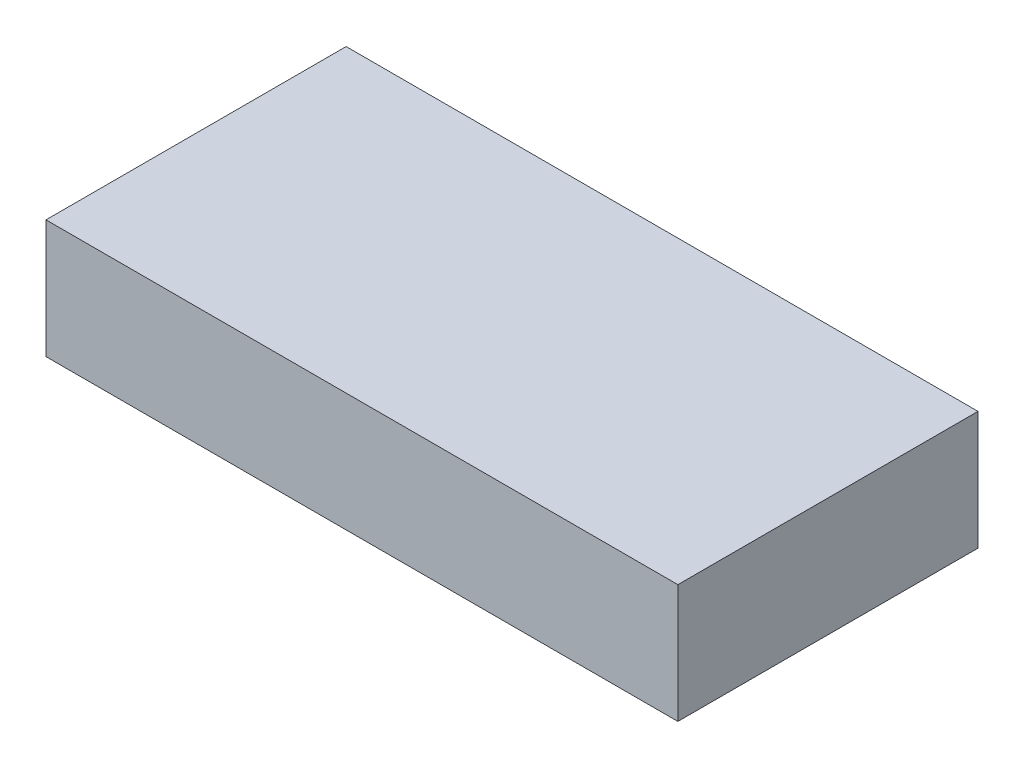
ISO-10303-21;
HEADER;
FILE_DESCRIPTION(('STEP AP214'),'2;1');
FILE_NAME('part.step','',(''),(''),'','','');
FILE_SCHEMA(('AUTOMOTIVE_DESIGN { 1 0 10303 214 1 1 1 1 }'));
ENDSEC;
DATA;
#1=APPLICATION_CONTEXT('core data for automotive mechanical design processes');
#2=APPLICATION_PROTOCOL_DEFINITION('international standard','automotive_design',2000,#1);
#3=PRODUCT_CONTEXT('',#1,'mechanical');
#4=PRODUCT('Part','Part','',(#3));
#5=PRODUCT_RELATED_PRODUCT_CATEGORY('part','',(#4));
#6=PRODUCT_DEFINITION_FORMATION('','',#4);
#7=PRODUCT_DEFINITION_CONTEXT('part definition',#1,'design');
#8=PRODUCT_DEFINITION('design','',#6,#7);
#9=PRODUCT_DEFINITION_SHAPE('','',#8);
#10=(LENGTH_UNIT() NAMED_UNIT(*) SI_UNIT(.MILLI.,.METRE.));
#11=(NAMED_UNIT(*) PLANE_ANGLE_UNIT() SI_UNIT($,.RADIAN.));
#12=(NAMED_UNIT(*) SI_UNIT($,.STERADIAN.) SOLID_ANGLE_UNIT());
#13=UNCERTAINTY_MEASURE_WITH_UNIT(LENGTH_MEASURE(1.E-05),#10,'distance_accuracy_value','');
#14=(GEOMETRIC_REPRESENTATION_CONTEXT(3) GLOBAL_UNCERTAINTY_ASSIGNED_CONTEXT((#13)) GLOBAL_UNIT_ASSIGNED_CONTEXT((#10,
#11,#12)) REPRESENTATION_CONTEXT('',''));
#15=CARTESIAN_POINT('',(0.,0.,0.));
#16=DIRECTION('',(0.,0.,1.));
#17=DIRECTION('',(1.,0.,0.));
#18=AXIS2_PLACEMENT_3D('',#15,#16,#17);
#19=CARTESIAN_POINT('',(0.,15.,0.));
#20=DIRECTION('',(-1.,0.,0.));
#21=DIRECTION('',(0.,0.,1.));
#22=AXIS2_PLACEMENT_3D('',#19,#20,#21);
#23=PLANE('',#22);
#24=DIRECTION('',(0.,0.,-1.));
#25=VECTOR('',#24,1.);
#26=CARTESIAN_POINT('',(0.,0.,0.));
#27=LINE('',#26,#25);
#28=CARTESIAN_POINT('',(0.,0.,38.));
#29=VERTEX_POINT('',#28);
#30=CARTESIAN_POINT('',(0.,0.,0.));
#31=VERTEX_POINT('',#30);
#32=EDGE_CURVE('E98',#29,#31,#27,.T.);
#33=ORIENTED_EDGE('',*,*,#32,.T.);
#34=DIRECTION('',(0.,-1.,0.));
#35=VECTOR('',#34,1.);
#36=CARTESIAN_POINT('',(0.,15.,0.));
#37=LINE('',#36,#35);
#38=CARTESIAN_POINT('',(0.,15.,0.));
#39=VERTEX_POINT('',#38);
#40=EDGE_CURVE('E11',#39,#31,#37,.T.);
#41=ORIENTED_EDGE('',*,*,#40,.F.);
#42=DIRECTION('',(0.,0.,-1.));
#43=VECTOR('',#42,1.);
#44=CARTESIAN_POINT('',(0.,15.,0.));
#45=LINE('',#44,#43);
#46=CARTESIAN_POINT('',(0.,15.,38.));
#47=VERTEX_POINT('',#46);
#48=EDGE_CURVE('E86',#47,#39,#45,.T.);
#49=ORIENTED_EDGE('',*,*,#48,.F.);
#50=DIRECTION('',(0.,-1.,0.));
#51=VECTOR('',#50,1.);
#52=CARTESIAN_POINT('',(0.,15.,38.));
#53=LINE('',#52,#51);
#54=EDGE_CURVE('E94',#47,#29,#53,.T.);
#55=ORIENTED_EDGE('',*,*,#54,.T.);
#56=EDGE_LOOP('',(#33,#41,#49,#55));
#57=FACE_BOUND('',#56,.T.);
#58=ADVANCED_FACE('F35',(#57),#23,.F.);
#59=CARTESIAN_POINT('',(0.,15.,0.));
#60=DIRECTION('',(0.,0.,1.));
#61=DIRECTION('',(1.,0.,0.));
#62=AXIS2_PLACEMENT_3D('',#59,#60,#61);
#63=PLANE('',#62);
#64=DIRECTION('',(-1.,0.,0.));
#65=VECTOR('',#64,1.);
#66=CARTESIAN_POINT('',(0.,0.,0.));
#67=LINE('',#66,#65);
#68=CARTESIAN_POINT('',(-80.,0.,0.));
#69=VERTEX_POINT('',#68);
#70=EDGE_CURVE('E90',#31,#69,#67,.T.);
#71=ORIENTED_EDGE('',*,*,#70,.T.);
#72=DIRECTION('',(0.,-1.,0.));
#73=VECTOR('',#72,1.);
#74=CARTESIAN_POINT('',(-80.,15.,0.));
#75=LINE('',#74,#73);
#76=CARTESIAN_POINT('',(-80.,15.,0.));
#77=VERTEX_POINT('',#76);
#78=EDGE_CURVE('E43',#77,#69,#75,.T.);
#79=ORIENTED_EDGE('',*,*,#78,.F.);
#80=DIRECTION('',(-1.,0.,0.));
#81=VECTOR('',#80,1.);
#82=CARTESIAN_POINT('',(0.,15.,0.));
#83=LINE('',#82,#81);
#84=EDGE_CURVE('E81',#39,#77,#83,.T.);
#85=ORIENTED_EDGE('',*,*,#84,.F.);
#86=ORIENTED_EDGE('',*,*,#40,.T.);
#87=EDGE_LOOP('',(#71,#79,#85,#86));
#88=FACE_BOUND('',#87,.T.);
#89=ADVANCED_FACE('F89',(#88),#63,.F.);
#90=CARTESIAN_POINT('',(-80.,15.,0.));
#91=DIRECTION('',(1.,0.,0.));
#92=DIRECTION('',(0.,0.,-1.));
#93=AXIS2_PLACEMENT_3D('',#90,#91,#92);
#94=PLANE('',#93);
#95=DIRECTION('',(0.,0.,1.));
#96=VECTOR('',#95,1.);
#97=CARTESIAN_POINT('',(-80.,0.,0.));
#98=LINE('',#97,#96);
#99=CARTESIAN_POINT('',(-80.,0.,38.));
#100=VERTEX_POINT('',#99);
#101=EDGE_CURVE('E68',#69,#100,#98,.T.);
#102=ORIENTED_EDGE('',*,*,#101,.T.);
#103=DIRECTION('',(0.,-1.,0.));
#104=VECTOR('',#103,1.);
#105=CARTESIAN_POINT('',(-80.,15.,38.));
#106=LINE('',#105,#104);
#107=CARTESIAN_POINT('',(-80.,15.,38.));
#108=VERTEX_POINT('',#107);
#109=EDGE_CURVE('E91',#108,#100,#106,.T.);
#110=ORIENTED_EDGE('',*,*,#109,.F.);
#111=DIRECTION('',(0.,0.,1.));
#112=VECTOR('',#111,1.);
#113=CARTESIAN_POINT('',(-80.,15.,0.));
#114=LINE('',#113,#112);
#115=EDGE_CURVE('E84',#77,#108,#114,.T.);
#116=ORIENTED_EDGE('',*,*,#115,.F.);
#117=ORIENTED_EDGE('',*,*,#78,.T.);
#118=EDGE_LOOP('',(#102,#110,#116,#117));
#119=FACE_BOUND('',#118,.T.);
#120=ADVANCED_FACE('F92',(#119),#94,.F.);
#121=CARTESIAN_POINT('',(0.,15.,38.));
#122=DIRECTION('',(0.,0.,-1.));
#123=DIRECTION('',(-1.,0.,0.));
#124=AXIS2_PLACEMENT_3D('',#121,#122,#123);
#125=PLANE('',#124);
#126=DIRECTION('',(1.,0.,0.));
#127=VECTOR('',#126,1.);
#128=CARTESIAN_POINT('',(0.,0.,38.));
#129=LINE('',#128,#127);
#130=EDGE_CURVE('E74',#100,#29,#129,.T.);
#131=ORIENTED_EDGE('',*,*,#130,.T.);
#132=ORIENTED_EDGE('',*,*,#54,.F.);
#133=DIRECTION('',(1.,0.,0.));
#134=VECTOR('',#133,1.);
#135=CARTESIAN_POINT('',(0.,15.,38.));
#136=LINE('',#135,#134);
#137=EDGE_CURVE('E51',#108,#47,#136,.T.);
#138=ORIENTED_EDGE('',*,*,#137,.F.);
#139=ORIENTED_EDGE('',*,*,#109,.T.);
#140=EDGE_LOOP('',(#131,#132,#138,#139));
#141=FACE_BOUND('',#140,.T.);
#142=ADVANCED_FACE('F105',(#141),#125,.F.);
#143=CARTESIAN_POINT('',(0.,15.,0.));
#144=DIRECTION('',(0.,-1.,0.));
#145=DIRECTION('',(0.,0.,-1.));
#146=AXIS2_PLACEMENT_3D('',#143,#144,#145);
#147=PLANE('',#146);
#148=ORIENTED_EDGE('',*,*,#48,.T.);
#149=ORIENTED_EDGE('',*,*,#84,.T.);
#150=ORIENTED_EDGE('',*,*,#115,.T.);
#151=ORIENTED_EDGE('',*,*,#137,.T.);
#152=EDGE_LOOP('',(#148,#149,#150,#151));
#153=FACE_BOUND('',#152,.T.);
#154=ADVANCED_FACE('F82',(#153),#147,.F.);
#155=CARTESIAN_POINT('',(0.,0.,0.));
#156=DIRECTION('',(0.,-1.,0.));
#157=DIRECTION('',(0.,0.,-1.));
#158=AXIS2_PLACEMENT_3D('',#155,#156,#157);
#159=PLANE('',#158);
#160=ORIENTED_EDGE('',*,*,#32,.F.);
#161=ORIENTED_EDGE('',*,*,#130,.F.);
#162=ORIENTED_EDGE('',*,*,#101,.F.);
#163=ORIENTED_EDGE('',*,*,#70,.F.);
#164=EDGE_LOOP('',(#160,#161,#162,#163));
#165=FACE_BOUND('',#164,.T.);
#166=ADVANCED_FACE('F108',(#165),#159,.T.);
#167=CLOSED_SHELL('',(#58,#89,#120,#142,#154,#166));
#168=MANIFOLD_SOLID_BREP('B2',#167);
#169=ADVANCED_BREP_SHAPE_REPRESENTATION('',(#18,#168),#14);
#170=SHAPE_DEFINITION_REPRESENTATION(#9,#169);
ENDSEC;
END-ISO-10303-21;
